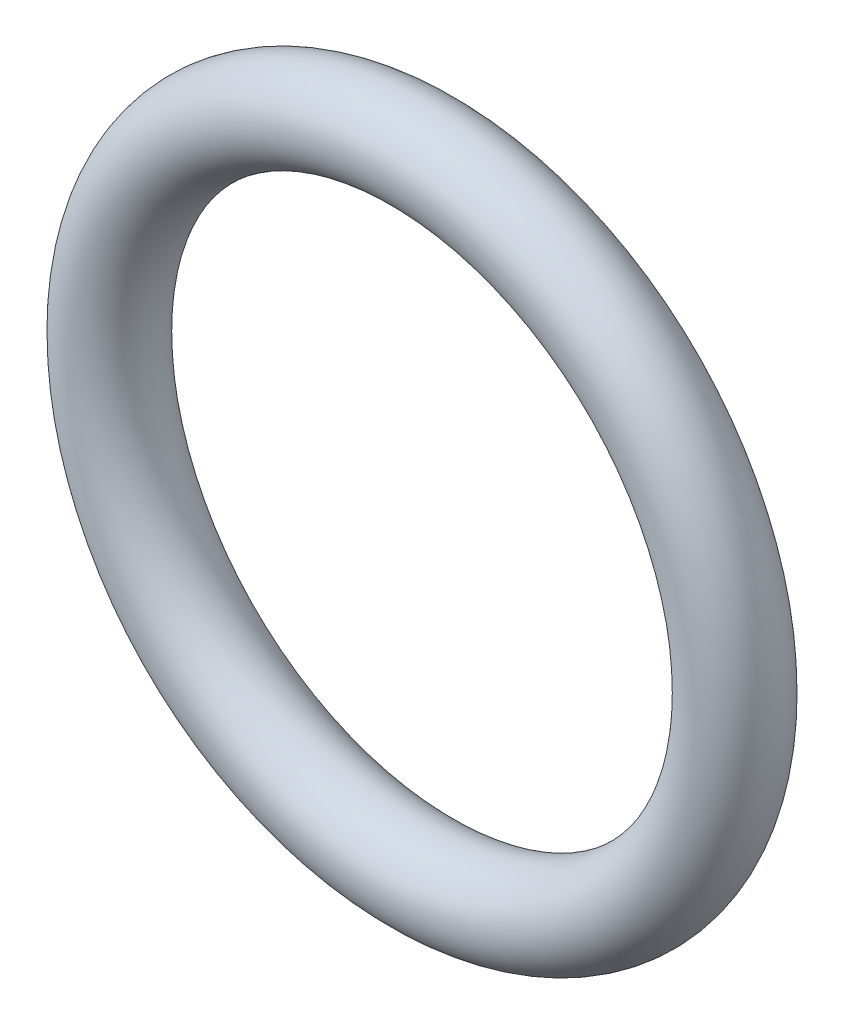
ISO-10303-21;
HEADER;
FILE_DESCRIPTION(('STEP AP214'),'2;1');
FILE_NAME('part.step','',(''),(''),'','','');
FILE_SCHEMA(('AUTOMOTIVE_DESIGN { 1 0 10303 214 1 1 1 1 }'));
ENDSEC;
DATA;
#1=APPLICATION_CONTEXT('core data for automotive mechanical design processes');
#2=APPLICATION_PROTOCOL_DEFINITION('international standard','automotive_design',2000,#1);
#3=PRODUCT_CONTEXT('',#1,'mechanical');
#4=PRODUCT('Part','Part','',(#3));
#5=PRODUCT_RELATED_PRODUCT_CATEGORY('part','',(#4));
#6=PRODUCT_DEFINITION_FORMATION('','',#4);
#7=PRODUCT_DEFINITION_CONTEXT('part definition',#1,'design');
#8=PRODUCT_DEFINITION('design','',#6,#7);
#9=PRODUCT_DEFINITION_SHAPE('','',#8);
#10=(LENGTH_UNIT() NAMED_UNIT(*) SI_UNIT(.MILLI.,.METRE.));
#11=(NAMED_UNIT(*) PLANE_ANGLE_UNIT() SI_UNIT($,.RADIAN.));
#12=(NAMED_UNIT(*) SI_UNIT($,.STERADIAN.) SOLID_ANGLE_UNIT());
#13=UNCERTAINTY_MEASURE_WITH_UNIT(LENGTH_MEASURE(1.E-05),#10,'distance_accuracy_value','');
#14=(GEOMETRIC_REPRESENTATION_CONTEXT(3) GLOBAL_UNCERTAINTY_ASSIGNED_CONTEXT((#13)) GLOBAL_UNIT_ASSIGNED_CONTEXT((#10,
#11,#12)) REPRESENTATION_CONTEXT('',''));
#15=CARTESIAN_POINT('',(0.,0.,0.));
#16=DIRECTION('',(0.,0.,1.));
#17=DIRECTION('',(1.,0.,0.));
#18=AXIS2_PLACEMENT_3D('',#15,#16,#17);
#19=CARTESIAN_POINT('',(0.,0.,0.));
#20=DIRECTION('',(0.,0.,1.));
#21=DIRECTION('',(1.,0.,0.));
#22=AXIS2_PLACEMENT_3D('',#19,#20,#21);
#23=TOROIDAL_SURFACE('',#22,6.2992,0.888999999999998);
#24=CARTESIAN_POINT('',(7.1882,0.,0.));
#25=VERTEX_POINT('',#24);
#26=VERTEX_LOOP('',#25);
#27=FACE_BOUND('',#26,.T.);
#28=ADVANCED_FACE('F33',(#27),#23,.T.);
#29=CLOSED_SHELL('',(#28));
#30=MANIFOLD_SOLID_BREP('B2',#29);
#31=ADVANCED_BREP_SHAPE_REPRESENTATION('',(#18,#30),#14);
#32=SHAPE_DEFINITION_REPRESENTATION(#9,#31);
ENDSEC;
END-ISO-10303-21;
